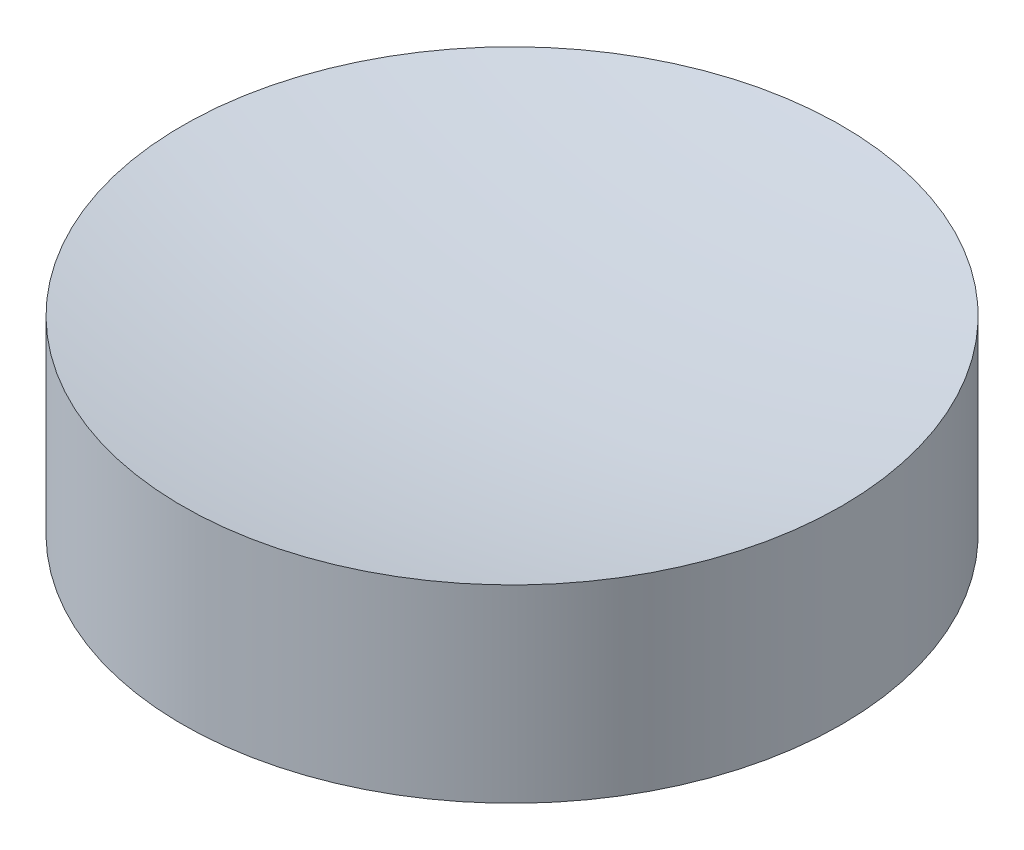
ISO-10303-21;
HEADER;
FILE_DESCRIPTION(('STEP AP214'),'2;1');
FILE_NAME('part.step','',(''),(''),'','','');
FILE_SCHEMA(('AUTOMOTIVE_DESIGN { 1 0 10303 214 1 1 1 1 }'));
ENDSEC;
DATA;
#1=APPLICATION_CONTEXT('core data for automotive mechanical design processes');
#2=APPLICATION_PROTOCOL_DEFINITION('international standard','automotive_design',2000,#1);
#3=PRODUCT_CONTEXT('',#1,'mechanical');
#4=PRODUCT('Part','Part','',(#3));
#5=PRODUCT_RELATED_PRODUCT_CATEGORY('part','',(#4));
#6=PRODUCT_DEFINITION_FORMATION('','',#4);
#7=PRODUCT_DEFINITION_CONTEXT('part definition',#1,'design');
#8=PRODUCT_DEFINITION('design','',#6,#7);
#9=PRODUCT_DEFINITION_SHAPE('','',#8);
#10=(LENGTH_UNIT() NAMED_UNIT(*) SI_UNIT(.MILLI.,.METRE.));
#11=(NAMED_UNIT(*) PLANE_ANGLE_UNIT() SI_UNIT($,.RADIAN.));
#12=(NAMED_UNIT(*) SI_UNIT($,.STERADIAN.) SOLID_ANGLE_UNIT());
#13=UNCERTAINTY_MEASURE_WITH_UNIT(LENGTH_MEASURE(1.E-05),#10,'distance_accuracy_value','');
#14=(GEOMETRIC_REPRESENTATION_CONTEXT(3) GLOBAL_UNCERTAINTY_ASSIGNED_CONTEXT((#13)) GLOBAL_UNIT_ASSIGNED_CONTEXT((#10,
#11,#12)) REPRESENTATION_CONTEXT('',''));
#15=CARTESIAN_POINT('',(0.,0.,0.));
#16=DIRECTION('',(0.,0.,1.));
#17=DIRECTION('',(1.,0.,0.));
#18=AXIS2_PLACEMENT_3D('',#15,#16,#17);
#19=CARTESIAN_POINT('',(2.8421709430404E-13,5141.40733418679,-699.260009999996));
#20=DIRECTION('',(0.,0.,-1.));
#21=DIRECTION('',(0.,-1.,0.));
#22=AXIS2_PLACEMENT_3D('',#19,#20,#21);
#23=SPHERICAL_SURFACE('',#22,172.29861655879);
#24=CARTESIAN_POINT('',(-1.1502863251876E-12,4984.87358936455,-699.260009999996));
#25=DIRECTION('',(0.,-1.,0.));
#26=DIRECTION('',(1.,0.,0.));
#27=AXIS2_PLACEMENT_3D('',#24,#25,#26);
#28=CIRCLE('',#27,72.);
#29=CARTESIAN_POINT('',(71.9999999999989,4984.87358936455,-699.260009999996));
#30=VERTEX_POINT('',#29);
#31=EDGE_CURVE('E19',#30,#30,#28,.F.);
#32=ORIENTED_EDGE('',*,*,#31,.F.);
#33=EDGE_LOOP('',(#32));
#34=FACE_BOUND('',#33,.T.);
#35=ADVANCED_FACE('F15',(#34),#23,.T.);
#36=CARTESIAN_POINT('',(0.,5388.89198160114,-699.260009999996));
#37=DIRECTION('',(0.,0.,1.));
#38=DIRECTION('',(0.,-1.,0.));
#39=AXIS2_PLACEMENT_3D('',#36,#37,#38);
#40=SPHERICAL_SURFACE('',#39,369.783263973143);
#41=CARTESIAN_POINT('',(-1.06581410363969E-13,5026.18595419791,-699.260009999996));
#42=DIRECTION('',(0.,-1.,0.));
#43=DIRECTION('',(1.,0.,0.));
#44=AXIS2_PLACEMENT_3D('',#41,#42,#43);
#45=CIRCLE('',#44,72.);
#46=CARTESIAN_POINT('',(71.9999999999999,5026.18595419791,-699.260009999996));
#47=VERTEX_POINT('',#46);
#48=EDGE_CURVE('E10',#47,#47,#45,.T.);
#49=ORIENTED_EDGE('',*,*,#48,.F.);
#50=EDGE_LOOP('',(#49));
#51=FACE_BOUND('',#50,.T.);
#52=ADVANCED_FACE('F30',(#51),#40,.F.);
#53=CARTESIAN_POINT('',(-1.06581410364015E-13,5026.18595419791,-699.260009999996));
#54=DIRECTION('',(0.,-1.,0.));
#55=DIRECTION('',(1.,0.,0.));
#56=AXIS2_PLACEMENT_3D('',#53,#54,#55);
#57=CYLINDRICAL_SURFACE('',#56,72.);
#58=ORIENTED_EDGE('',*,*,#48,.T.);
#59=EDGE_LOOP('',(#58));
#60=FACE_BOUND('',#59,.T.);
#61=ORIENTED_EDGE('',*,*,#31,.T.);
#62=EDGE_LOOP('',(#61));
#63=FACE_BOUND('',#62,.T.);
#64=ADVANCED_FACE('F17',(#60,#63),#57,.T.);
#65=CLOSED_SHELL('',(#35,#52,#64));
#66=MANIFOLD_SOLID_BREP('B1',#65);
#67=ADVANCED_BREP_SHAPE_REPRESENTATION('',(#18,#66),#14);
#68=SHAPE_DEFINITION_REPRESENTATION(#9,#67);
ENDSEC;
END-ISO-10303-21;
